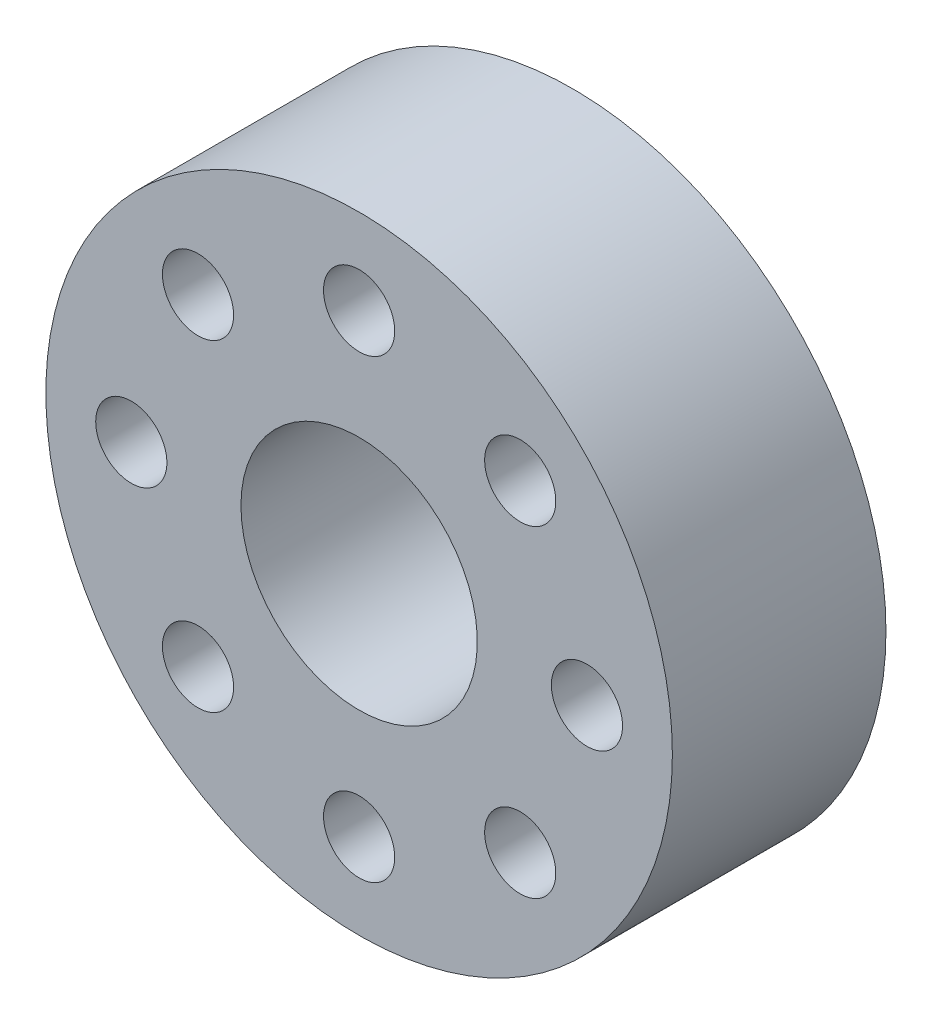
ISO-10303-21;
HEADER;
FILE_DESCRIPTION(('STEP AP214'),'2;1');
FILE_NAME('part.step','',(''),(''),'','','');
FILE_SCHEMA(('AUTOMOTIVE_DESIGN { 1 0 10303 214 1 1 1 1 }'));
ENDSEC;
DATA;
#1=APPLICATION_CONTEXT('core data for automotive mechanical design processes');
#2=APPLICATION_PROTOCOL_DEFINITION('international standard','automotive_design',2000,#1);
#3=PRODUCT_CONTEXT('',#1,'mechanical');
#4=PRODUCT('Part','Part','',(#3));
#5=PRODUCT_RELATED_PRODUCT_CATEGORY('part','',(#4));
#6=PRODUCT_DEFINITION_FORMATION('','',#4);
#7=PRODUCT_DEFINITION_CONTEXT('part definition',#1,'design');
#8=PRODUCT_DEFINITION('design','',#6,#7);
#9=PRODUCT_DEFINITION_SHAPE('','',#8);
#10=(LENGTH_UNIT() NAMED_UNIT(*) SI_UNIT(.MILLI.,.METRE.));
#11=(NAMED_UNIT(*) PLANE_ANGLE_UNIT() SI_UNIT($,.RADIAN.));
#12=(NAMED_UNIT(*) SI_UNIT($,.STERADIAN.) SOLID_ANGLE_UNIT());
#13=UNCERTAINTY_MEASURE_WITH_UNIT(LENGTH_MEASURE(1.E-05),#10,'distance_accuracy_value','');
#14=(GEOMETRIC_REPRESENTATION_CONTEXT(3) GLOBAL_UNCERTAINTY_ASSIGNED_CONTEXT((#13)) GLOBAL_UNIT_ASSIGNED_CONTEXT((#10,
#11,#12)) REPRESENTATION_CONTEXT('',''));
#15=CARTESIAN_POINT('',(0.,0.,0.));
#16=DIRECTION('',(0.,0.,1.));
#17=DIRECTION('',(1.,0.,0.));
#18=AXIS2_PLACEMENT_3D('',#15,#16,#17);
#19=CARTESIAN_POINT('',(0.,0.,7.5));
#20=DIRECTION('',(0.,0.,-1.));
#21=DIRECTION('',(-1.,0.,0.));
#22=AXIS2_PLACEMENT_3D('',#19,#20,#21);
#23=CYLINDRICAL_SURFACE('',#22,11.);
#24=CARTESIAN_POINT('',(0.,0.,7.5));
#25=DIRECTION('',(0.,0.,1.));
#26=DIRECTION('',(1.,0.,0.));
#27=AXIS2_PLACEMENT_3D('',#24,#25,#26);
#28=CIRCLE('',#27,11.);
#29=CARTESIAN_POINT('',(11.,0.,7.5));
#30=VERTEX_POINT('',#29);
#31=EDGE_CURVE('E10',#30,#30,#28,.T.);
#32=ORIENTED_EDGE('',*,*,#31,.F.);
#33=EDGE_LOOP('',(#32));
#34=FACE_BOUND('',#33,.T.);
#35=CARTESIAN_POINT('',(0.,0.,0.));
#36=DIRECTION('',(0.,0.,1.));
#37=DIRECTION('',(1.,0.,0.));
#38=AXIS2_PLACEMENT_3D('',#35,#36,#37);
#39=CIRCLE('',#38,11.);
#40=CARTESIAN_POINT('',(11.,0.,0.));
#41=VERTEX_POINT('',#40);
#42=EDGE_CURVE('E46',#41,#41,#39,.T.);
#43=ORIENTED_EDGE('',*,*,#42,.T.);
#44=EDGE_LOOP('',(#43));
#45=FACE_BOUND('',#44,.T.);
#46=ADVANCED_FACE('F43',(#34,#45),#23,.T.);
#47=CARTESIAN_POINT('',(0.,0.,7.5));
#48=DIRECTION('',(0.,0.,1.));
#49=DIRECTION('',(1.,0.,0.));
#50=AXIS2_PLACEMENT_3D('',#47,#48,#49);
#51=PLANE('',#50);
#52=CARTESIAN_POINT('',(-8.,0.,7.5));
#53=DIRECTION('',(0.,0.,-1.));
#54=DIRECTION('',(-1.,0.,0.));
#55=AXIS2_PLACEMENT_3D('',#52,#53,#54);
#56=CIRCLE('',#55,1.25);
#57=CARTESIAN_POINT('',(-9.25,0.,7.5));
#58=VERTEX_POINT('',#57);
#59=EDGE_CURVE('E90',#58,#58,#56,.T.);
#60=ORIENTED_EDGE('',*,*,#59,.T.);
#61=EDGE_LOOP('',(#60));
#62=FACE_BOUND('',#61,.T.);
#63=CARTESIAN_POINT('',(-5.65685424949237,-5.65685424949239,7.5));
#64=DIRECTION('',(0.,0.,-1.));
#65=DIRECTION('',(-1.,0.,0.));
#66=AXIS2_PLACEMENT_3D('',#63,#64,#65);
#67=CIRCLE('',#66,1.25);
#68=CARTESIAN_POINT('',(-6.90685424949237,-5.65685424949239,7.5));
#69=VERTEX_POINT('',#68);
#70=EDGE_CURVE('E82',#69,#69,#67,.T.);
#71=ORIENTED_EDGE('',*,*,#70,.T.);
#72=EDGE_LOOP('',(#71));
#73=FACE_BOUND('',#72,.T.);
#74=CARTESIAN_POINT('',(0.,-8.,7.5));
#75=DIRECTION('',(0.,0.,-1.));
#76=DIRECTION('',(-1.,0.,0.));
#77=AXIS2_PLACEMENT_3D('',#74,#75,#76);
#78=CIRCLE('',#77,1.25);
#79=CARTESIAN_POINT('',(-1.24999999999997,-8.,7.5));
#80=VERTEX_POINT('',#79);
#81=EDGE_CURVE('E74',#80,#80,#78,.T.);
#82=ORIENTED_EDGE('',*,*,#81,.T.);
#83=EDGE_LOOP('',(#82));
#84=FACE_BOUND('',#83,.T.);
#85=CARTESIAN_POINT('',(5.65685424949241,-5.65685424949235,7.5));
#86=DIRECTION('',(0.,0.,-1.));
#87=DIRECTION('',(-1.,0.,0.));
#88=AXIS2_PLACEMENT_3D('',#85,#86,#87);
#89=CIRCLE('',#88,1.25);
#90=CARTESIAN_POINT('',(4.40685424949241,-5.65685424949235,7.5));
#91=VERTEX_POINT('',#90);
#92=EDGE_CURVE('E65',#91,#91,#89,.T.);
#93=ORIENTED_EDGE('',*,*,#92,.T.);
#94=EDGE_LOOP('',(#93));
#95=FACE_BOUND('',#94,.T.);
#96=CARTESIAN_POINT('',(8.,0.,7.5));
#97=DIRECTION('',(0.,0.,-1.));
#98=DIRECTION('',(-1.,0.,0.));
#99=AXIS2_PLACEMENT_3D('',#96,#97,#98);
#100=CIRCLE('',#99,1.25);
#101=CARTESIAN_POINT('',(6.75,0.,7.5));
#102=VERTEX_POINT('',#101);
#103=EDGE_CURVE('E121',#102,#102,#100,.T.);
#104=ORIENTED_EDGE('',*,*,#103,.T.);
#105=EDGE_LOOP('',(#104));
#106=FACE_BOUND('',#105,.T.);
#107=CARTESIAN_POINT('',(5.65685424949233,5.65685424949243,7.5));
#108=DIRECTION('',(0.,0.,-1.));
#109=DIRECTION('',(-1.,0.,0.));
#110=AXIS2_PLACEMENT_3D('',#107,#108,#109);
#111=CIRCLE('',#110,1.25);
#112=CARTESIAN_POINT('',(4.40685424949233,5.65685424949243,7.5));
#113=VERTEX_POINT('',#112);
#114=EDGE_CURVE('E113',#113,#113,#111,.T.);
#115=ORIENTED_EDGE('',*,*,#114,.T.);
#116=EDGE_LOOP('',(#115));
#117=FACE_BOUND('',#116,.T.);
#118=CARTESIAN_POINT('',(0.,8.,7.5));
#119=DIRECTION('',(0.,0.,-1.));
#120=DIRECTION('',(-1.,0.,0.));
#121=AXIS2_PLACEMENT_3D('',#118,#119,#120);
#122=CIRCLE('',#121,1.25);
#123=CARTESIAN_POINT('',(-1.25000000000008,8.,7.5));
#124=VERTEX_POINT('',#123);
#125=EDGE_CURVE('E105',#124,#124,#122,.T.);
#126=ORIENTED_EDGE('',*,*,#125,.T.);
#127=EDGE_LOOP('',(#126));
#128=FACE_BOUND('',#127,.T.);
#129=CARTESIAN_POINT('',(-5.65685424949245,5.65685424949231,7.5));
#130=DIRECTION('',(0.,0.,-1.));
#131=DIRECTION('',(-1.,0.,0.));
#132=AXIS2_PLACEMENT_3D('',#129,#130,#131);
#133=CIRCLE('',#132,1.25);
#134=CARTESIAN_POINT('',(-6.90685424949245,5.65685424949231,7.5));
#135=VERTEX_POINT('',#134);
#136=EDGE_CURVE('E97',#135,#135,#133,.T.);
#137=ORIENTED_EDGE('',*,*,#136,.T.);
#138=EDGE_LOOP('',(#137));
#139=FACE_BOUND('',#138,.T.);
#140=CARTESIAN_POINT('',(0.,0.,7.5));
#141=DIRECTION('',(0.,0.,-1.));
#142=DIRECTION('',(-1.,0.,0.));
#143=AXIS2_PLACEMENT_3D('',#140,#141,#142);
#144=CIRCLE('',#143,4.15);
#145=CARTESIAN_POINT('',(-4.15,0.,7.5));
#146=VERTEX_POINT('',#145);
#147=EDGE_CURVE('E55',#146,#146,#144,.T.);
#148=ORIENTED_EDGE('',*,*,#147,.T.);
#149=EDGE_LOOP('',(#148));
#150=FACE_BOUND('',#149,.T.);
#151=ORIENTED_EDGE('',*,*,#31,.T.);
#152=EDGE_LOOP('',(#151));
#153=FACE_BOUND('',#152,.T.);
#154=ADVANCED_FACE('F135',(#62,#73,#84,#95,#106,#117,#128,#139,#150,#153),#51,.T.);
#155=CARTESIAN_POINT('',(0.,0.,0.));
#156=DIRECTION('',(0.,0.,1.));
#157=DIRECTION('',(1.,0.,0.));
#158=AXIS2_PLACEMENT_3D('',#155,#156,#157);
#159=PLANE('',#158);
#160=CARTESIAN_POINT('',(-8.,0.,0.));
#161=DIRECTION('',(0.,0.,-1.));
#162=DIRECTION('',(-1.,0.,0.));
#163=AXIS2_PLACEMENT_3D('',#160,#161,#162);
#164=CIRCLE('',#163,1.25);
#165=CARTESIAN_POINT('',(-9.25,0.,0.));
#166=VERTEX_POINT('',#165);
#167=EDGE_CURVE('E61',#166,#166,#164,.T.);
#168=ORIENTED_EDGE('',*,*,#167,.F.);
#169=EDGE_LOOP('',(#168));
#170=FACE_BOUND('',#169,.T.);
#171=CARTESIAN_POINT('',(-5.65685424949237,-5.65685424949239,0.));
#172=DIRECTION('',(0.,0.,-1.));
#173=DIRECTION('',(-1.,0.,0.));
#174=AXIS2_PLACEMENT_3D('',#171,#172,#173);
#175=CIRCLE('',#174,1.25);
#176=CARTESIAN_POINT('',(-6.90685424949237,-5.65685424949239,0.));
#177=VERTEX_POINT('',#176);
#178=EDGE_CURVE('E86',#177,#177,#175,.T.);
#179=ORIENTED_EDGE('',*,*,#178,.F.);
#180=EDGE_LOOP('',(#179));
#181=FACE_BOUND('',#180,.T.);
#182=CARTESIAN_POINT('',(0.,-8.,0.));
#183=DIRECTION('',(0.,0.,-1.));
#184=DIRECTION('',(-1.,0.,0.));
#185=AXIS2_PLACEMENT_3D('',#182,#183,#184);
#186=CIRCLE('',#185,1.25);
#187=CARTESIAN_POINT('',(-1.24999999999997,-8.,0.));
#188=VERTEX_POINT('',#187);
#189=EDGE_CURVE('E78',#188,#188,#186,.T.);
#190=ORIENTED_EDGE('',*,*,#189,.F.);
#191=EDGE_LOOP('',(#190));
#192=FACE_BOUND('',#191,.T.);
#193=CARTESIAN_POINT('',(5.65685424949241,-5.65685424949235,0.));
#194=DIRECTION('',(0.,0.,-1.));
#195=DIRECTION('',(-1.,0.,0.));
#196=AXIS2_PLACEMENT_3D('',#193,#194,#195);
#197=CIRCLE('',#196,1.25);
#198=CARTESIAN_POINT('',(4.40685424949241,-5.65685424949235,0.));
#199=VERTEX_POINT('',#198);
#200=EDGE_CURVE('E69',#199,#199,#197,.T.);
#201=ORIENTED_EDGE('',*,*,#200,.F.);
#202=EDGE_LOOP('',(#201));
#203=FACE_BOUND('',#202,.T.);
#204=CARTESIAN_POINT('',(8.,0.,0.));
#205=DIRECTION('',(0.,0.,-1.));
#206=DIRECTION('',(-1.,0.,0.));
#207=AXIS2_PLACEMENT_3D('',#204,#205,#206);
#208=CIRCLE('',#207,1.25);
#209=CARTESIAN_POINT('',(6.75,0.,0.));
#210=VERTEX_POINT('',#209);
#211=EDGE_CURVE('E70',#210,#210,#208,.T.);
#212=ORIENTED_EDGE('',*,*,#211,.F.);
#213=EDGE_LOOP('',(#212));
#214=FACE_BOUND('',#213,.T.);
#215=CARTESIAN_POINT('',(5.65685424949233,5.65685424949243,0.));
#216=DIRECTION('',(0.,0.,-1.));
#217=DIRECTION('',(-1.,0.,0.));
#218=AXIS2_PLACEMENT_3D('',#215,#216,#217);
#219=CIRCLE('',#218,1.25);
#220=CARTESIAN_POINT('',(4.40685424949233,5.65685424949243,0.));
#221=VERTEX_POINT('',#220);
#222=EDGE_CURVE('E117',#221,#221,#219,.T.);
#223=ORIENTED_EDGE('',*,*,#222,.F.);
#224=EDGE_LOOP('',(#223));
#225=FACE_BOUND('',#224,.T.);
#226=CARTESIAN_POINT('',(0.,8.,0.));
#227=DIRECTION('',(0.,0.,-1.));
#228=DIRECTION('',(-1.,0.,0.));
#229=AXIS2_PLACEMENT_3D('',#226,#227,#228);
#230=CIRCLE('',#229,1.25);
#231=CARTESIAN_POINT('',(-1.25000000000008,8.,0.));
#232=VERTEX_POINT('',#231);
#233=EDGE_CURVE('E109',#232,#232,#230,.T.);
#234=ORIENTED_EDGE('',*,*,#233,.F.);
#235=EDGE_LOOP('',(#234));
#236=FACE_BOUND('',#235,.T.);
#237=CARTESIAN_POINT('',(-5.65685424949245,5.65685424949231,0.));
#238=DIRECTION('',(0.,0.,-1.));
#239=DIRECTION('',(-1.,0.,0.));
#240=AXIS2_PLACEMENT_3D('',#237,#238,#239);
#241=CIRCLE('',#240,1.25);
#242=CARTESIAN_POINT('',(-6.90685424949245,5.65685424949231,0.));
#243=VERTEX_POINT('',#242);
#244=EDGE_CURVE('E101',#243,#243,#241,.T.);
#245=ORIENTED_EDGE('',*,*,#244,.F.);
#246=EDGE_LOOP('',(#245));
#247=FACE_BOUND('',#246,.T.);
#248=CARTESIAN_POINT('',(0.,0.,0.));
#249=DIRECTION('',(0.,0.,-1.));
#250=DIRECTION('',(-1.,0.,0.));
#251=AXIS2_PLACEMENT_3D('',#248,#249,#250);
#252=CIRCLE('',#251,4.15);
#253=CARTESIAN_POINT('',(-4.15,0.,0.));
#254=VERTEX_POINT('',#253);
#255=EDGE_CURVE('E57',#254,#254,#252,.T.);
#256=ORIENTED_EDGE('',*,*,#255,.F.);
#257=EDGE_LOOP('',(#256));
#258=FACE_BOUND('',#257,.T.);
#259=ORIENTED_EDGE('',*,*,#42,.F.);
#260=EDGE_LOOP('',(#259));
#261=FACE_BOUND('',#260,.T.);
#262=ADVANCED_FACE('F131',(#170,#181,#192,#203,#214,#225,#236,#247,#258,#261),#159,.F.);
#263=CARTESIAN_POINT('',(0.,0.,7.5));
#264=DIRECTION('',(0.,0.,-1.));
#265=DIRECTION('',(-1.,0.,0.));
#266=AXIS2_PLACEMENT_3D('',#263,#264,#265);
#267=CYLINDRICAL_SURFACE('',#266,4.15);
#268=ORIENTED_EDGE('',*,*,#147,.F.);
#269=EDGE_LOOP('',(#268));
#270=FACE_BOUND('',#269,.T.);
#271=ORIENTED_EDGE('',*,*,#255,.T.);
#272=EDGE_LOOP('',(#271));
#273=FACE_BOUND('',#272,.T.);
#274=ADVANCED_FACE('F134',(#270,#273),#267,.F.);
#275=CARTESIAN_POINT('',(-5.65685424949245,5.65685424949231,7.5));
#276=DIRECTION('',(0.,0.,-1.));
#277=DIRECTION('',(-1.,0.,0.));
#278=AXIS2_PLACEMENT_3D('',#275,#276,#277);
#279=CYLINDRICAL_SURFACE('',#278,1.25);
#280=ORIENTED_EDGE('',*,*,#136,.F.);
#281=EDGE_LOOP('',(#280));
#282=FACE_BOUND('',#281,.T.);
#283=ORIENTED_EDGE('',*,*,#244,.T.);
#284=EDGE_LOOP('',(#283));
#285=FACE_BOUND('',#284,.T.);
#286=ADVANCED_FACE('F160',(#282,#285),#279,.F.);
#287=CARTESIAN_POINT('',(0.,8.,7.5));
#288=DIRECTION('',(0.,0.,-1.));
#289=DIRECTION('',(-1.,0.,0.));
#290=AXIS2_PLACEMENT_3D('',#287,#288,#289);
#291=CYLINDRICAL_SURFACE('',#290,1.25);
#292=ORIENTED_EDGE('',*,*,#125,.F.);
#293=EDGE_LOOP('',(#292));
#294=FACE_BOUND('',#293,.T.);
#295=ORIENTED_EDGE('',*,*,#233,.T.);
#296=EDGE_LOOP('',(#295));
#297=FACE_BOUND('',#296,.T.);
#298=ADVANCED_FACE('F180',(#294,#297),#291,.F.);
#299=CARTESIAN_POINT('',(5.65685424949233,5.65685424949243,7.5));
#300=DIRECTION('',(0.,0.,-1.));
#301=DIRECTION('',(-1.,0.,0.));
#302=AXIS2_PLACEMENT_3D('',#299,#300,#301);
#303=CYLINDRICAL_SURFACE('',#302,1.25);
#304=ORIENTED_EDGE('',*,*,#114,.F.);
#305=EDGE_LOOP('',(#304));
#306=FACE_BOUND('',#305,.T.);
#307=ORIENTED_EDGE('',*,*,#222,.T.);
#308=EDGE_LOOP('',(#307));
#309=FACE_BOUND('',#308,.T.);
#310=ADVANCED_FACE('F184',(#306,#309),#303,.F.);
#311=CARTESIAN_POINT('',(8.,0.,7.5));
#312=DIRECTION('',(0.,0.,-1.));
#313=DIRECTION('',(-1.,0.,0.));
#314=AXIS2_PLACEMENT_3D('',#311,#312,#313);
#315=CYLINDRICAL_SURFACE('',#314,1.25);
#316=ORIENTED_EDGE('',*,*,#103,.F.);
#317=EDGE_LOOP('',(#316));
#318=FACE_BOUND('',#317,.T.);
#319=ORIENTED_EDGE('',*,*,#211,.T.);
#320=EDGE_LOOP('',(#319));
#321=FACE_BOUND('',#320,.T.);
#322=ADVANCED_FACE('F129',(#318,#321),#315,.F.);
#323=CARTESIAN_POINT('',(5.65685424949241,-5.65685424949235,7.5));
#324=DIRECTION('',(0.,0.,-1.));
#325=DIRECTION('',(-1.,0.,0.));
#326=AXIS2_PLACEMENT_3D('',#323,#324,#325);
#327=CYLINDRICAL_SURFACE('',#326,1.25);
#328=ORIENTED_EDGE('',*,*,#92,.F.);
#329=EDGE_LOOP('',(#328));
#330=FACE_BOUND('',#329,.T.);
#331=ORIENTED_EDGE('',*,*,#200,.T.);
#332=EDGE_LOOP('',(#331));
#333=FACE_BOUND('',#332,.T.);
#334=ADVANCED_FACE('F162',(#330,#333),#327,.F.);
#335=CARTESIAN_POINT('',(0.,-8.,7.5));
#336=DIRECTION('',(0.,0.,-1.));
#337=DIRECTION('',(-1.,0.,0.));
#338=AXIS2_PLACEMENT_3D('',#335,#336,#337);
#339=CYLINDRICAL_SURFACE('',#338,1.25);
#340=ORIENTED_EDGE('',*,*,#81,.F.);
#341=EDGE_LOOP('',(#340));
#342=FACE_BOUND('',#341,.T.);
#343=ORIENTED_EDGE('',*,*,#189,.T.);
#344=EDGE_LOOP('',(#343));
#345=FACE_BOUND('',#344,.T.);
#346=ADVANCED_FACE('F165',(#342,#345),#339,.F.);
#347=CARTESIAN_POINT('',(-5.65685424949237,-5.65685424949239,7.5));
#348=DIRECTION('',(0.,0.,-1.));
#349=DIRECTION('',(-1.,0.,0.));
#350=AXIS2_PLACEMENT_3D('',#347,#348,#349);
#351=CYLINDRICAL_SURFACE('',#350,1.25);
#352=ORIENTED_EDGE('',*,*,#70,.F.);
#353=EDGE_LOOP('',(#352));
#354=FACE_BOUND('',#353,.T.);
#355=ORIENTED_EDGE('',*,*,#178,.T.);
#356=EDGE_LOOP('',(#355));
#357=FACE_BOUND('',#356,.T.);
#358=ADVANCED_FACE('F169',(#354,#357),#351,.F.);
#359=CARTESIAN_POINT('',(-8.,0.,7.5));
#360=DIRECTION('',(0.,0.,-1.));
#361=DIRECTION('',(-1.,0.,0.));
#362=AXIS2_PLACEMENT_3D('',#359,#360,#361);
#363=CYLINDRICAL_SURFACE('',#362,1.25);
#364=ORIENTED_EDGE('',*,*,#59,.F.);
#365=EDGE_LOOP('',(#364));
#366=FACE_BOUND('',#365,.T.);
#367=ORIENTED_EDGE('',*,*,#167,.T.);
#368=EDGE_LOOP('',(#367));
#369=FACE_BOUND('',#368,.T.);
#370=ADVANCED_FACE('F173',(#366,#369),#363,.F.);
#371=CLOSED_SHELL('',(#46,#154,#262,#274,#286,#298,#310,#322,#334,#346,#358,#370));
#372=MANIFOLD_SOLID_BREP('B2',#371);
#373=ADVANCED_BREP_SHAPE_REPRESENTATION('',(#18,#372),#14);
#374=SHAPE_DEFINITION_REPRESENTATION(#9,#373);
ENDSEC;
END-ISO-10303-21;
